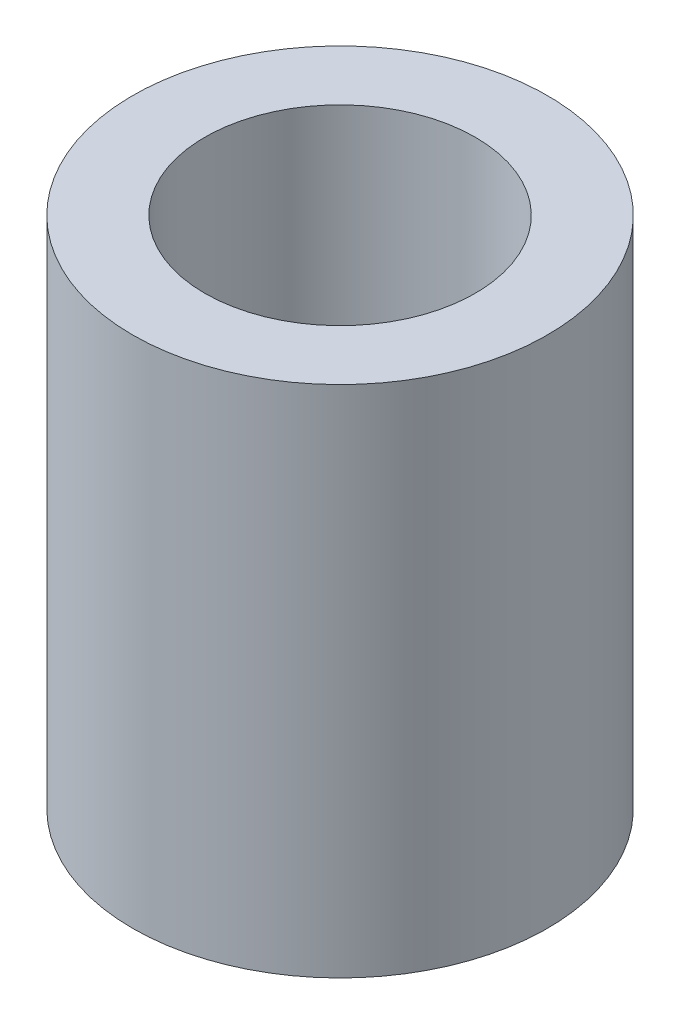
ISO-10303-21;
HEADER;
FILE_DESCRIPTION(('STEP AP214'),'2;1');
FILE_NAME('part.step','',(''),(''),'','','');
FILE_SCHEMA(('AUTOMOTIVE_DESIGN { 1 0 10303 214 1 1 1 1 }'));
ENDSEC;
DATA;
#1=APPLICATION_CONTEXT('core data for automotive mechanical design processes');
#2=APPLICATION_PROTOCOL_DEFINITION('international standard','automotive_design',2000,#1);
#3=PRODUCT_CONTEXT('',#1,'mechanical');
#4=PRODUCT('Part','Part','',(#3));
#5=PRODUCT_RELATED_PRODUCT_CATEGORY('part','',(#4));
#6=PRODUCT_DEFINITION_FORMATION('','',#4);
#7=PRODUCT_DEFINITION_CONTEXT('part definition',#1,'design');
#8=PRODUCT_DEFINITION('design','',#6,#7);
#9=PRODUCT_DEFINITION_SHAPE('','',#8);
#10=(LENGTH_UNIT() NAMED_UNIT(*) SI_UNIT(.MILLI.,.METRE.));
#11=(NAMED_UNIT(*) PLANE_ANGLE_UNIT() SI_UNIT($,.RADIAN.));
#12=(NAMED_UNIT(*) SI_UNIT($,.STERADIAN.) SOLID_ANGLE_UNIT());
#13=UNCERTAINTY_MEASURE_WITH_UNIT(LENGTH_MEASURE(1.E-05),#10,'distance_accuracy_value','');
#14=(GEOMETRIC_REPRESENTATION_CONTEXT(3) GLOBAL_UNCERTAINTY_ASSIGNED_CONTEXT((#13)) GLOBAL_UNIT_ASSIGNED_CONTEXT((#10,
#11,#12)) REPRESENTATION_CONTEXT('',''));
#15=CARTESIAN_POINT('',(0.,0.,0.));
#16=DIRECTION('',(0.,0.,1.));
#17=DIRECTION('',(1.,0.,0.));
#18=AXIS2_PLACEMENT_3D('',#15,#16,#17);
#19=CARTESIAN_POINT('',(0.,2.85,0.));
#20=DIRECTION('',(0.,1.,0.));
#21=DIRECTION('',(0.,0.,1.));
#22=AXIS2_PLACEMENT_3D('',#19,#20,#21);
#23=PLANE('',#22);
#24=CARTESIAN_POINT('',(0.,2.85,0.));
#25=DIRECTION('',(0.,1.,0.));
#26=DIRECTION('',(0.,0.,1.));
#27=AXIS2_PLACEMENT_3D('',#24,#25,#26);
#28=CIRCLE('',#27,2.3);
#29=CARTESIAN_POINT('',(0.,2.85,2.3));
#30=VERTEX_POINT('',#29);
#31=EDGE_CURVE('E10',#30,#30,#28,.T.);
#32=ORIENTED_EDGE('',*,*,#31,.T.);
#33=EDGE_LOOP('',(#32));
#34=FACE_BOUND('',#33,.T.);
#35=CARTESIAN_POINT('',(0.,2.85,0.));
#36=DIRECTION('',(0.,1.,0.));
#37=DIRECTION('',(0.,0.,1.));
#38=AXIS2_PLACEMENT_3D('',#35,#36,#37);
#39=CIRCLE('',#38,1.5);
#40=CARTESIAN_POINT('',(0.,2.85,1.5));
#41=VERTEX_POINT('',#40);
#42=EDGE_CURVE('E46',#41,#41,#39,.T.);
#43=ORIENTED_EDGE('',*,*,#42,.F.);
#44=EDGE_LOOP('',(#43));
#45=FACE_BOUND('',#44,.T.);
#46=ADVANCED_FACE('F35',(#34,#45),#23,.T.);
#47=CARTESIAN_POINT('',(0.,-2.85,0.));
#48=DIRECTION('',(0.,1.,0.));
#49=DIRECTION('',(0.,0.,1.));
#50=AXIS2_PLACEMENT_3D('',#47,#48,#49);
#51=PLANE('',#50);
#52=CARTESIAN_POINT('',(0.,-2.85,0.));
#53=DIRECTION('',(0.,1.,0.));
#54=DIRECTION('',(0.,0.,1.));
#55=AXIS2_PLACEMENT_3D('',#52,#53,#54);
#56=CIRCLE('',#55,2.3);
#57=CARTESIAN_POINT('',(0.,-2.85,2.3));
#58=VERTEX_POINT('',#57);
#59=EDGE_CURVE('E39',#58,#58,#56,.T.);
#60=ORIENTED_EDGE('',*,*,#59,.F.);
#61=EDGE_LOOP('',(#60));
#62=FACE_BOUND('',#61,.T.);
#63=CARTESIAN_POINT('',(0.,-2.85,0.));
#64=DIRECTION('',(0.,1.,0.));
#65=DIRECTION('',(0.,0.,1.));
#66=AXIS2_PLACEMENT_3D('',#63,#64,#65);
#67=CIRCLE('',#66,1.5);
#68=CARTESIAN_POINT('',(0.,-2.85,1.5));
#69=VERTEX_POINT('',#68);
#70=EDGE_CURVE('E48',#69,#69,#67,.T.);
#71=ORIENTED_EDGE('',*,*,#70,.T.);
#72=EDGE_LOOP('',(#71));
#73=FACE_BOUND('',#72,.T.);
#74=ADVANCED_FACE('F58',(#62,#73),#51,.F.);
#75=CARTESIAN_POINT('',(0.,2.85,0.));
#76=DIRECTION('',(0.,-1.,0.));
#77=DIRECTION('',(0.,0.,-1.));
#78=AXIS2_PLACEMENT_3D('',#75,#76,#77);
#79=CYLINDRICAL_SURFACE('',#78,2.3);
#80=ORIENTED_EDGE('',*,*,#31,.F.);
#81=EDGE_LOOP('',(#80));
#82=FACE_BOUND('',#81,.T.);
#83=ORIENTED_EDGE('',*,*,#59,.T.);
#84=EDGE_LOOP('',(#83));
#85=FACE_BOUND('',#84,.T.);
#86=ADVANCED_FACE('F37',(#82,#85),#79,.T.);
#87=CARTESIAN_POINT('',(0.,2.85,0.));
#88=DIRECTION('',(0.,-1.,0.));
#89=DIRECTION('',(0.,0.,-1.));
#90=AXIS2_PLACEMENT_3D('',#87,#88,#89);
#91=CYLINDRICAL_SURFACE('',#90,1.5);
#92=ORIENTED_EDGE('',*,*,#42,.T.);
#93=EDGE_LOOP('',(#92));
#94=FACE_BOUND('',#93,.T.);
#95=ORIENTED_EDGE('',*,*,#70,.F.);
#96=EDGE_LOOP('',(#95));
#97=FACE_BOUND('',#96,.T.);
#98=ADVANCED_FACE('F54',(#94,#97),#91,.F.);
#99=CLOSED_SHELL('',(#46,#74,#86,#98));
#100=MANIFOLD_SOLID_BREP('B2',#99);
#101=ADVANCED_BREP_SHAPE_REPRESENTATION('',(#18,#100),#14);
#102=SHAPE_DEFINITION_REPRESENTATION(#9,#101);
ENDSEC;
END-ISO-10303-21;
